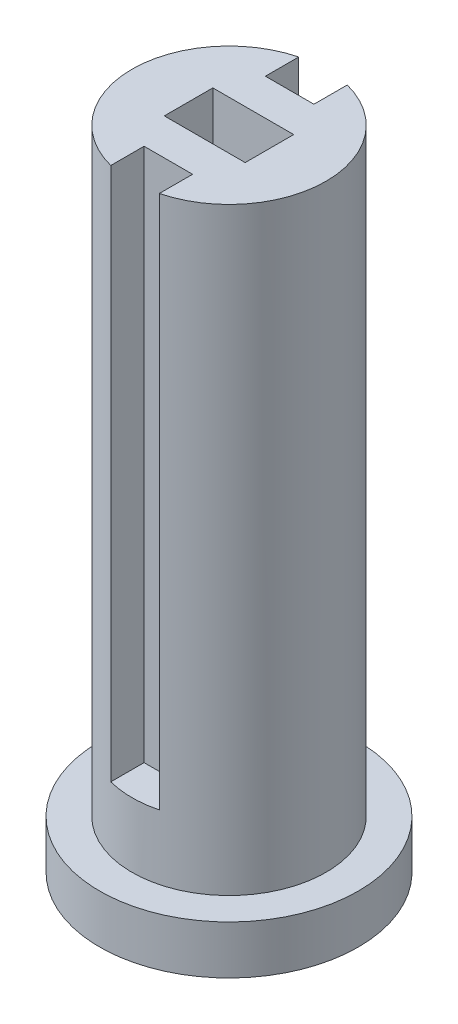
ISO-10303-21;
HEADER;
FILE_DESCRIPTION(('STEP AP214'),'2;1');
FILE_NAME('part.step','',(''),(''),'','','');
FILE_SCHEMA(('AUTOMOTIVE_DESIGN { 1 0 10303 214 1 1 1 1 }'));
ENDSEC;
DATA;
#1=APPLICATION_CONTEXT('core data for automotive mechanical design processes');
#2=APPLICATION_PROTOCOL_DEFINITION('international standard','automotive_design',2000,#1);
#3=PRODUCT_CONTEXT('',#1,'mechanical');
#4=PRODUCT('Part','Part','',(#3));
#5=PRODUCT_RELATED_PRODUCT_CATEGORY('part','',(#4));
#6=PRODUCT_DEFINITION_FORMATION('','',#4);
#7=PRODUCT_DEFINITION_CONTEXT('part definition',#1,'design');
#8=PRODUCT_DEFINITION('design','',#6,#7);
#9=PRODUCT_DEFINITION_SHAPE('','',#8);
#10=(LENGTH_UNIT() NAMED_UNIT(*) SI_UNIT(.MILLI.,.METRE.));
#11=(NAMED_UNIT(*) PLANE_ANGLE_UNIT() SI_UNIT($,.RADIAN.));
#12=(NAMED_UNIT(*) SI_UNIT($,.STERADIAN.) SOLID_ANGLE_UNIT());
#13=UNCERTAINTY_MEASURE_WITH_UNIT(LENGTH_MEASURE(1.E-05),#10,'distance_accuracy_value','');
#14=(GEOMETRIC_REPRESENTATION_CONTEXT(3) GLOBAL_UNCERTAINTY_ASSIGNED_CONTEXT((#13)) GLOBAL_UNIT_ASSIGNED_CONTEXT((#10,
#11,#12)) REPRESENTATION_CONTEXT('',''));
#15=CARTESIAN_POINT('',(0.,0.,0.));
#16=DIRECTION('',(0.,0.,1.));
#17=DIRECTION('',(1.,0.,0.));
#18=AXIS2_PLACEMENT_3D('',#15,#16,#17);
#19=CARTESIAN_POINT('',(-4.03061224489797,30.,0.));
#20=DIRECTION('',(0.,-1.,0.));
#21=DIRECTION('',(1.,0.,0.));
#22=AXIS2_PLACEMENT_3D('',#19,#20,#21);
#23=PLANE('',#22);
#24=DIRECTION('',(-1.,0.,0.));
#25=VECTOR('',#24,1.);
#26=CARTESIAN_POINT('',(-12.530612244898,30.,-1.5));
#27=LINE('',#26,#25);
#28=CARTESIAN_POINT('',(-7.53061224489797,30.,-1.5));
#29=VERTEX_POINT('',#28);
#30=CARTESIAN_POINT('',(-12.530612244898,30.,-1.5));
#31=VERTEX_POINT('',#30);
#32=EDGE_CURVE('E180',#29,#31,#27,.T.);
#33=ORIENTED_EDGE('',*,*,#32,.F.);
#34=DIRECTION('',(0.,0.,-1.));
#35=VECTOR('',#34,1.);
#36=CARTESIAN_POINT('',(-7.53061224489797,30.,0.499999999999999));
#37=LINE('',#36,#35);
#38=CARTESIAN_POINT('',(-7.53061224489797,30.,1.5));
#39=VERTEX_POINT('',#38);
#40=EDGE_CURVE('E187',#39,#29,#37,.T.);
#41=ORIENTED_EDGE('',*,*,#40,.F.);
#42=DIRECTION('',(1.,0.,0.));
#43=VECTOR('',#42,1.);
#44=CARTESIAN_POINT('',(-7.53061224489797,30.,1.5));
#45=LINE('',#44,#43);
#46=CARTESIAN_POINT('',(-12.530612244898,30.,1.5));
#47=VERTEX_POINT('',#46);
#48=EDGE_CURVE('E201',#47,#39,#45,.T.);
#49=ORIENTED_EDGE('',*,*,#48,.F.);
#50=DIRECTION('',(0.,0.,1.));
#51=VECTOR('',#50,1.);
#52=CARTESIAN_POINT('',(-12.530612244898,30.,1.5));
#53=LINE('',#52,#51);
#54=EDGE_CURVE('E198',#31,#47,#53,.T.);
#55=ORIENTED_EDGE('',*,*,#54,.F.);
#56=EDGE_LOOP('',(#33,#41,#49,#55));
#57=FACE_BOUND('',#56,.T.);
#58=DIRECTION('',(1.,0.,0.));
#59=VECTOR('',#58,1.);
#60=CARTESIAN_POINT('',(-10.030612244898,30.,-3.75));
#61=LINE('',#60,#59);
#62=CARTESIAN_POINT('',(-11.530612244898,30.,-3.75));
#63=VERTEX_POINT('',#62);
#64=CARTESIAN_POINT('',(-8.53061224489797,30.,-3.75));
#65=VERTEX_POINT('',#64);
#66=EDGE_CURVE('E143',#63,#65,#61,.T.);
#67=ORIENTED_EDGE('',*,*,#66,.F.);
#68=DIRECTION('',(0.,0.,1.));
#69=VECTOR('',#68,1.);
#70=CARTESIAN_POINT('',(-11.530612244898,30.,-3.75));
#71=LINE('',#70,#69);
#72=CARTESIAN_POINT('',(-11.530612244898,30.,-5.80947501931112));
#73=VERTEX_POINT('',#72);
#74=EDGE_CURVE('E156',#73,#63,#71,.T.);
#75=ORIENTED_EDGE('',*,*,#74,.F.);
#76=CARTESIAN_POINT('',(-10.030612244898,30.,0.));
#77=DIRECTION('',(0.,1.,0.));
#78=DIRECTION('',(-1.,0.,0.));
#79=AXIS2_PLACEMENT_3D('',#76,#77,#78);
#80=CIRCLE('',#79,6.);
#81=CARTESIAN_POINT('',(-11.530612244898,30.,5.80947501931112));
#82=VERTEX_POINT('',#81);
#83=EDGE_CURVE('E208',#73,#82,#80,.T.);
#84=ORIENTED_EDGE('',*,*,#83,.T.);
#85=DIRECTION('',(0.,0.,1.));
#86=VECTOR('',#85,1.);
#87=CARTESIAN_POINT('',(-11.530612244898,30.,3.75));
#88=LINE('',#87,#86);
#89=CARTESIAN_POINT('',(-11.530612244898,30.,3.75));
#90=VERTEX_POINT('',#89);
#91=EDGE_CURVE('E168',#90,#82,#88,.T.);
#92=ORIENTED_EDGE('',*,*,#91,.F.);
#93=DIRECTION('',(-1.,0.,0.));
#94=VECTOR('',#93,1.);
#95=CARTESIAN_POINT('',(-10.030612244898,30.,3.75));
#96=LINE('',#95,#94);
#97=CARTESIAN_POINT('',(-8.53061224489797,30.,3.75));
#98=VERTEX_POINT('',#97);
#99=EDGE_CURVE('E173',#98,#90,#96,.T.);
#100=ORIENTED_EDGE('',*,*,#99,.F.);
#101=DIRECTION('',(0.,0.,-1.));
#102=VECTOR('',#101,1.);
#103=CARTESIAN_POINT('',(-8.53061224489797,30.,6.14726512922367));
#104=LINE('',#103,#102);
#105=CARTESIAN_POINT('',(-8.53061224489797,30.,5.80947501931112));
#106=VERTEX_POINT('',#105);
#107=EDGE_CURVE('E163',#106,#98,#104,.T.);
#108=ORIENTED_EDGE('',*,*,#107,.F.);
#109=CARTESIAN_POINT('',(-8.53061224489797,30.,-5.80947501931112));
#110=VERTEX_POINT('',#109);
#111=EDGE_CURVE('E214',#106,#110,#80,.T.);
#112=ORIENTED_EDGE('',*,*,#111,.T.);
#113=DIRECTION('',(0.,0.,-1.));
#114=VECTOR('',#113,1.);
#115=CARTESIAN_POINT('',(-8.53061224489797,30.,-6.14726512922367));
#116=LINE('',#115,#114);
#117=EDGE_CURVE('E160',#65,#110,#116,.T.);
#118=ORIENTED_EDGE('',*,*,#117,.F.);
#119=EDGE_LOOP('',(#67,#75,#84,#92,#100,#108,#112,#118));
#120=FACE_BOUND('',#119,.T.);
#121=ADVANCED_FACE('F48',(#57,#120),#23,.F.);
#122=CARTESIAN_POINT('',(-10.030612244898,-10.,0.));
#123=DIRECTION('',(0.,1.,0.));
#124=DIRECTION('',(-1.,0.,0.));
#125=AXIS2_PLACEMENT_3D('',#122,#123,#124);
#126=PLANE('',#125);
#127=CARTESIAN_POINT('',(-10.030612244898,-10.,0.));
#128=DIRECTION('',(0.,1.,0.));
#129=DIRECTION('',(-1.,0.,0.));
#130=AXIS2_PLACEMENT_3D('',#127,#128,#129);
#131=CIRCLE('',#130,8.);
#132=CARTESIAN_POINT('',(-18.030612244898,-10.,0.));
#133=VERTEX_POINT('',#132);
#134=EDGE_CURVE('E223',#133,#133,#131,.T.);
#135=ORIENTED_EDGE('',*,*,#134,.F.);
#136=EDGE_LOOP('',(#135));
#137=FACE_BOUND('',#136,.T.);
#138=ADVANCED_FACE('F269',(#137),#126,.F.);
#139=CARTESIAN_POINT('',(-10.030612244898,30.,0.));
#140=DIRECTION('',(0.,1.,0.));
#141=DIRECTION('',(-1.,0.,0.));
#142=AXIS2_PLACEMENT_3D('',#139,#140,#141);
#143=CYLINDRICAL_SURFACE('',#142,8.);
#144=CARTESIAN_POINT('',(-10.030612244898,-7.,0.));
#145=DIRECTION('',(0.,1.,0.));
#146=DIRECTION('',(-1.,0.,0.));
#147=AXIS2_PLACEMENT_3D('',#144,#145,#146);
#148=CIRCLE('',#147,8.);
#149=CARTESIAN_POINT('',(-18.030612244898,-7.,0.));
#150=VERTEX_POINT('',#149);
#151=EDGE_CURVE('E220',#150,#150,#148,.T.);
#152=ORIENTED_EDGE('',*,*,#151,.F.);
#153=EDGE_LOOP('',(#152));
#154=FACE_BOUND('',#153,.T.);
#155=ORIENTED_EDGE('',*,*,#134,.T.);
#156=EDGE_LOOP('',(#155));
#157=FACE_BOUND('',#156,.T.);
#158=ADVANCED_FACE('F274',(#154,#157),#143,.T.);
#159=CARTESIAN_POINT('',(-2.03061224489796,-7.,0.));
#160=DIRECTION('',(0.,-1.,0.));
#161=DIRECTION('',(1.,0.,0.));
#162=AXIS2_PLACEMENT_3D('',#159,#160,#161);
#163=PLANE('',#162);
#164=CARTESIAN_POINT('',(-10.030612244898,-7.00000000000001,0.));
#165=DIRECTION('',(0.,1.,0.));
#166=DIRECTION('',(-1.,0.,0.));
#167=AXIS2_PLACEMENT_3D('',#164,#165,#166);
#168=CIRCLE('',#167,6.);
#169=CARTESIAN_POINT('',(-16.030612244898,-7.00000000000001,0.));
#170=VERTEX_POINT('',#169);
#171=EDGE_CURVE('E217',#170,#170,#168,.T.);
#172=ORIENTED_EDGE('',*,*,#171,.F.);
#173=EDGE_LOOP('',(#172));
#174=FACE_BOUND('',#173,.T.);
#175=ORIENTED_EDGE('',*,*,#151,.T.);
#176=EDGE_LOOP('',(#175));
#177=FACE_BOUND('',#176,.T.);
#178=ADVANCED_FACE('F312',(#174,#177),#163,.F.);
#179=CARTESIAN_POINT('',(-10.030612244898,30.,0.));
#180=DIRECTION('',(0.,1.,0.));
#181=DIRECTION('',(-1.,0.,0.));
#182=AXIS2_PLACEMENT_3D('',#179,#180,#181);
#183=CYLINDRICAL_SURFACE('',#182,6.);
#184=ORIENTED_EDGE('',*,*,#83,.F.);
#185=DIRECTION('',(0.,1.,0.));
#186=VECTOR('',#185,1.);
#187=CARTESIAN_POINT('',(-11.530612244898,30.,-5.80947501931112));
#188=LINE('',#187,#186);
#189=CARTESIAN_POINT('',(-11.530612244898,-3.00000000000001,-5.80947501931112));
#190=VERTEX_POINT('',#189);
#191=EDGE_CURVE('E13',#73,#190,#188,.F.);
#192=ORIENTED_EDGE('',*,*,#191,.T.);
#193=CARTESIAN_POINT('',(-10.030612244898,-3.00000000000001,0.));
#194=DIRECTION('',(0.,-1.,0.));
#195=DIRECTION('',(0.,0.,-1.));
#196=AXIS2_PLACEMENT_3D('',#193,#194,#195);
#197=CIRCLE('',#196,6.);
#198=CARTESIAN_POINT('',(-8.53061224489797,-3.00000000000001,-5.80947501931112));
#199=VERTEX_POINT('',#198);
#200=EDGE_CURVE('E234',#190,#199,#197,.T.);
#201=ORIENTED_EDGE('',*,*,#200,.T.);
#202=DIRECTION('',(0.,1.,0.));
#203=VECTOR('',#202,1.);
#204=CARTESIAN_POINT('',(-8.53061224489797,30.,-5.80947501931112));
#205=LINE('',#204,#203);
#206=EDGE_CURVE('E55',#199,#110,#205,.T.);
#207=ORIENTED_EDGE('',*,*,#206,.T.);
#208=ORIENTED_EDGE('',*,*,#111,.F.);
#209=DIRECTION('',(0.,1.,0.));
#210=VECTOR('',#209,1.);
#211=CARTESIAN_POINT('',(-8.53061224489797,30.,5.80947501931112));
#212=LINE('',#211,#210);
#213=CARTESIAN_POINT('',(-8.53061224489797,-3.00000000000001,5.80947501931112));
#214=VERTEX_POINT('',#213);
#215=EDGE_CURVE('E231',#106,#214,#212,.F.);
#216=ORIENTED_EDGE('',*,*,#215,.T.);
#217=CARTESIAN_POINT('',(-10.030612244898,-3.00000000000001,0.));
#218=DIRECTION('',(0.,1.,0.));
#219=DIRECTION('',(0.,0.,1.));
#220=AXIS2_PLACEMENT_3D('',#217,#218,#219);
#221=CIRCLE('',#220,6.);
#222=CARTESIAN_POINT('',(-11.530612244898,-3.00000000000001,5.80947501931112));
#223=VERTEX_POINT('',#222);
#224=EDGE_CURVE('E226',#223,#214,#221,.T.);
#225=ORIENTED_EDGE('',*,*,#224,.F.);
#226=DIRECTION('',(0.,1.,0.));
#227=VECTOR('',#226,1.);
#228=CARTESIAN_POINT('',(-11.530612244898,30.,5.80947501931112));
#229=LINE('',#228,#227);
#230=EDGE_CURVE('E228',#223,#82,#229,.T.);
#231=ORIENTED_EDGE('',*,*,#230,.T.);
#232=EDGE_LOOP('',(#184,#192,#201,#207,#208,#216,#225,#231));
#233=FACE_BOUND('',#232,.T.);
#234=ORIENTED_EDGE('',*,*,#171,.T.);
#235=EDGE_LOOP('',(#234));
#236=FACE_BOUND('',#235,.T.);
#237=ADVANCED_FACE('F238',(#233,#236),#183,.T.);
#238=CARTESIAN_POINT('',(-7.53061224489797,22.,0.499999999999999));
#239=DIRECTION('',(1.,0.,0.));
#240=DIRECTION('',(0.,0.,-1.));
#241=AXIS2_PLACEMENT_3D('',#238,#239,#240);
#242=PLANE('',#241);
#243=ORIENTED_EDGE('',*,*,#40,.T.);
#244=DIRECTION('',(0.,1.,0.));
#245=VECTOR('',#244,1.);
#246=CARTESIAN_POINT('',(-7.53061224489797,22.,-1.5));
#247=LINE('',#246,#245);
#248=CARTESIAN_POINT('',(-7.53061224489797,22.,-1.5));
#249=VERTEX_POINT('',#248);
#250=EDGE_CURVE('E195',#249,#29,#247,.T.);
#251=ORIENTED_EDGE('',*,*,#250,.F.);
#252=DIRECTION('',(0.,0.,-1.));
#253=VECTOR('',#252,1.);
#254=CARTESIAN_POINT('',(-7.53061224489797,22.,-0.500000000000002));
#255=LINE('',#254,#253);
#256=CARTESIAN_POINT('',(-7.53061224489797,22.,1.5));
#257=VERTEX_POINT('',#256);
#258=EDGE_CURVE('E183',#257,#249,#255,.T.);
#259=ORIENTED_EDGE('',*,*,#258,.F.);
#260=DIRECTION('',(0.,1.,0.));
#261=VECTOR('',#260,1.);
#262=CARTESIAN_POINT('',(-7.53061224489797,22.,1.5));
#263=LINE('',#262,#261);
#264=EDGE_CURVE('E206',#257,#39,#263,.T.);
#265=ORIENTED_EDGE('',*,*,#264,.T.);
#266=EDGE_LOOP('',(#243,#251,#259,#265));
#267=FACE_BOUND('',#266,.T.);
#268=ADVANCED_FACE('F285',(#267),#242,.F.);
#269=CARTESIAN_POINT('',(-7.53061224489797,22.,1.5));
#270=DIRECTION('',(0.,0.,1.));
#271=DIRECTION('',(1.,0.,0.));
#272=AXIS2_PLACEMENT_3D('',#269,#270,#271);
#273=PLANE('',#272);
#274=ORIENTED_EDGE('',*,*,#48,.T.);
#275=ORIENTED_EDGE('',*,*,#264,.F.);
#276=DIRECTION('',(1.,0.,0.));
#277=VECTOR('',#276,1.);
#278=CARTESIAN_POINT('',(-7.53061224489797,22.,1.5));
#279=LINE('',#278,#277);
#280=CARTESIAN_POINT('',(-12.530612244898,22.,1.5));
#281=VERTEX_POINT('',#280);
#282=EDGE_CURVE('E192',#281,#257,#279,.T.);
#283=ORIENTED_EDGE('',*,*,#282,.F.);
#284=DIRECTION('',(0.,1.,0.));
#285=VECTOR('',#284,1.);
#286=CARTESIAN_POINT('',(-12.530612244898,22.,1.5));
#287=LINE('',#286,#285);
#288=EDGE_CURVE('E209',#281,#47,#287,.T.);
#289=ORIENTED_EDGE('',*,*,#288,.T.);
#290=EDGE_LOOP('',(#274,#275,#283,#289));
#291=FACE_BOUND('',#290,.T.);
#292=ADVANCED_FACE('F289',(#291),#273,.F.);
#293=CARTESIAN_POINT('',(-12.530612244898,22.,1.5));
#294=DIRECTION('',(-1.,0.,0.));
#295=DIRECTION('',(0.,-1.,0.));
#296=AXIS2_PLACEMENT_3D('',#293,#294,#295);
#297=PLANE('',#296);
#298=ORIENTED_EDGE('',*,*,#54,.T.);
#299=ORIENTED_EDGE('',*,*,#288,.F.);
#300=DIRECTION('',(0.,0.,1.));
#301=VECTOR('',#300,1.);
#302=CARTESIAN_POINT('',(-12.530612244898,22.,-0.5));
#303=LINE('',#302,#301);
#304=CARTESIAN_POINT('',(-12.530612244898,22.,-1.5));
#305=VERTEX_POINT('',#304);
#306=EDGE_CURVE('E190',#305,#281,#303,.T.);
#307=ORIENTED_EDGE('',*,*,#306,.F.);
#308=DIRECTION('',(0.,1.,0.));
#309=VECTOR('',#308,1.);
#310=CARTESIAN_POINT('',(-12.530612244898,22.,-1.5));
#311=LINE('',#310,#309);
#312=EDGE_CURVE('E211',#305,#31,#311,.T.);
#313=ORIENTED_EDGE('',*,*,#312,.T.);
#314=EDGE_LOOP('',(#298,#299,#307,#313));
#315=FACE_BOUND('',#314,.T.);
#316=ADVANCED_FACE('F292',(#315),#297,.F.);
#317=CARTESIAN_POINT('',(-12.530612244898,22.,-1.5));
#318=DIRECTION('',(0.,0.,-1.));
#319=DIRECTION('',(-1.,0.,0.));
#320=AXIS2_PLACEMENT_3D('',#317,#318,#319);
#321=PLANE('',#320);
#322=ORIENTED_EDGE('',*,*,#32,.T.);
#323=ORIENTED_EDGE('',*,*,#312,.F.);
#324=DIRECTION('',(-1.,0.,0.));
#325=VECTOR('',#324,1.);
#326=CARTESIAN_POINT('',(-12.530612244898,22.,-1.5));
#327=LINE('',#326,#325);
#328=EDGE_CURVE('E186',#249,#305,#327,.T.);
#329=ORIENTED_EDGE('',*,*,#328,.F.);
#330=ORIENTED_EDGE('',*,*,#250,.T.);
#331=EDGE_LOOP('',(#322,#323,#329,#330));
#332=FACE_BOUND('',#331,.T.);
#333=ADVANCED_FACE('F281',(#332),#321,.F.);
#334=CARTESIAN_POINT('',(0.,22.,0.));
#335=DIRECTION('',(0.,-1.,0.));
#336=DIRECTION('',(0.,0.,-1.));
#337=AXIS2_PLACEMENT_3D('',#334,#335,#336);
#338=PLANE('',#337);
#339=ORIENTED_EDGE('',*,*,#258,.T.);
#340=ORIENTED_EDGE('',*,*,#328,.T.);
#341=ORIENTED_EDGE('',*,*,#306,.T.);
#342=ORIENTED_EDGE('',*,*,#282,.T.);
#343=EDGE_LOOP('',(#339,#340,#341,#342));
#344=FACE_BOUND('',#343,.T.);
#345=ADVANCED_FACE('F294',(#344),#338,.F.);
#346=CARTESIAN_POINT('',(-8.53061224489797,-3.00000000000001,6.14726512922367));
#347=DIRECTION('',(1.,0.,0.));
#348=DIRECTION('',(0.,1.,0.));
#349=AXIS2_PLACEMENT_3D('',#346,#347,#348);
#350=PLANE('',#349);
#351=ORIENTED_EDGE('',*,*,#107,.T.);
#352=DIRECTION('',(0.,1.,0.));
#353=VECTOR('',#352,1.);
#354=CARTESIAN_POINT('',(-8.53061224489797,-3.00000000000001,3.75));
#355=LINE('',#354,#353);
#356=CARTESIAN_POINT('',(-8.53061224489797,-3.00000000000001,3.75));
#357=VERTEX_POINT('',#356);
#358=EDGE_CURVE('E171',#357,#98,#355,.T.);
#359=ORIENTED_EDGE('',*,*,#358,.F.);
#360=DIRECTION('',(0.,0.,-1.));
#361=VECTOR('',#360,1.);
#362=CARTESIAN_POINT('',(-8.53061224489797,-3.00000000000001,6.14726512922367));
#363=LINE('',#362,#361);
#364=EDGE_CURVE('E165',#214,#357,#363,.T.);
#365=ORIENTED_EDGE('',*,*,#364,.F.);
#366=ORIENTED_EDGE('',*,*,#215,.F.);
#367=EDGE_LOOP('',(#351,#359,#365,#366));
#368=FACE_BOUND('',#367,.T.);
#369=ADVANCED_FACE('F246',(#368),#350,.F.);
#370=CARTESIAN_POINT('',(-11.530612244898,-3.00000000000001,3.75));
#371=DIRECTION('',(-1.,0.,0.));
#372=DIRECTION('',(0.,-1.,0.));
#373=AXIS2_PLACEMENT_3D('',#370,#371,#372);
#374=PLANE('',#373);
#375=DIRECTION('',(0.,0.,1.));
#376=VECTOR('',#375,1.);
#377=CARTESIAN_POINT('',(-11.530612244898,-3.00000000000001,3.75));
#378=LINE('',#377,#376);
#379=CARTESIAN_POINT('',(-11.530612244898,-3.00000000000001,3.75));
#380=VERTEX_POINT('',#379);
#381=EDGE_CURVE('E70',#380,#223,#378,.T.);
#382=ORIENTED_EDGE('',*,*,#381,.F.);
#383=DIRECTION('',(0.,1.,0.));
#384=VECTOR('',#383,1.);
#385=CARTESIAN_POINT('',(-11.530612244898,-3.00000000000001,3.75));
#386=LINE('',#385,#384);
#387=EDGE_CURVE('E178',#380,#90,#386,.T.);
#388=ORIENTED_EDGE('',*,*,#387,.T.);
#389=ORIENTED_EDGE('',*,*,#91,.T.);
#390=ORIENTED_EDGE('',*,*,#230,.F.);
#391=EDGE_LOOP('',(#382,#388,#389,#390));
#392=FACE_BOUND('',#391,.T.);
#393=ADVANCED_FACE('F255',(#392),#374,.F.);
#394=CARTESIAN_POINT('',(0.,-3.00000000000001,0.));
#395=DIRECTION('',(0.,1.,0.));
#396=DIRECTION('',(0.,0.,1.));
#397=AXIS2_PLACEMENT_3D('',#394,#395,#396);
#398=PLANE('',#397);
#399=ORIENTED_EDGE('',*,*,#224,.T.);
#400=ORIENTED_EDGE('',*,*,#364,.T.);
#401=DIRECTION('',(-1.,0.,0.));
#402=VECTOR('',#401,1.);
#403=CARTESIAN_POINT('',(-8.53061224489797,-3.00000000000001,3.75));
#404=LINE('',#403,#402);
#405=EDGE_CURVE('E167',#357,#380,#404,.T.);
#406=ORIENTED_EDGE('',*,*,#405,.T.);
#407=ORIENTED_EDGE('',*,*,#381,.T.);
#408=EDGE_LOOP('',(#399,#400,#406,#407));
#409=FACE_BOUND('',#408,.T.);
#410=ADVANCED_FACE('F252',(#409),#398,.T.);
#411=CARTESIAN_POINT('',(-10.030612244898,-3.00000000000001,3.75));
#412=DIRECTION('',(0.,0.,-1.));
#413=DIRECTION('',(-1.,0.,0.));
#414=AXIS2_PLACEMENT_3D('',#411,#412,#413);
#415=PLANE('',#414);
#416=ORIENTED_EDGE('',*,*,#99,.T.);
#417=ORIENTED_EDGE('',*,*,#387,.F.);
#418=ORIENTED_EDGE('',*,*,#405,.F.);
#419=ORIENTED_EDGE('',*,*,#358,.T.);
#420=EDGE_LOOP('',(#416,#417,#418,#419));
#421=FACE_BOUND('',#420,.T.);
#422=ADVANCED_FACE('F250',(#421),#415,.F.);
#423=CARTESIAN_POINT('',(-11.530612244898,-3.00000000000001,-3.75));
#424=DIRECTION('',(-1.,0.,0.));
#425=DIRECTION('',(0.,-1.,0.));
#426=AXIS2_PLACEMENT_3D('',#423,#424,#425);
#427=PLANE('',#426);
#428=ORIENTED_EDGE('',*,*,#74,.T.);
#429=DIRECTION('',(0.,1.,0.));
#430=VECTOR('',#429,1.);
#431=CARTESIAN_POINT('',(-11.530612244898,-3.00000000000001,-3.75));
#432=LINE('',#431,#430);
#433=CARTESIAN_POINT('',(-11.530612244898,-3.00000000000001,-3.75));
#434=VERTEX_POINT('',#433);
#435=EDGE_CURVE('E146',#434,#63,#432,.T.);
#436=ORIENTED_EDGE('',*,*,#435,.F.);
#437=DIRECTION('',(0.,0.,1.));
#438=VECTOR('',#437,1.);
#439=CARTESIAN_POINT('',(-11.530612244898,-3.00000000000001,-3.75));
#440=LINE('',#439,#438);
#441=EDGE_CURVE('E147',#190,#434,#440,.T.);
#442=ORIENTED_EDGE('',*,*,#441,.F.);
#443=ORIENTED_EDGE('',*,*,#191,.F.);
#444=EDGE_LOOP('',(#428,#436,#442,#443));
#445=FACE_BOUND('',#444,.T.);
#446=ADVANCED_FACE('F258',(#445),#427,.F.);
#447=CARTESIAN_POINT('',(-8.53061224489797,-3.00000000000001,-6.14726512922367));
#448=DIRECTION('',(1.,0.,0.));
#449=DIRECTION('',(0.,1.,0.));
#450=AXIS2_PLACEMENT_3D('',#447,#448,#449);
#451=PLANE('',#450);
#452=DIRECTION('',(0.,0.,-1.));
#453=VECTOR('',#452,1.);
#454=CARTESIAN_POINT('',(-8.53061224489797,-3.00000000000001,-6.14726512922367));
#455=LINE('',#454,#453);
#456=CARTESIAN_POINT('',(-8.53061224489797,-3.00000000000001,-3.75));
#457=VERTEX_POINT('',#456);
#458=EDGE_CURVE('E62',#457,#199,#455,.T.);
#459=ORIENTED_EDGE('',*,*,#458,.F.);
#460=DIRECTION('',(0.,1.,0.));
#461=VECTOR('',#460,1.);
#462=CARTESIAN_POINT('',(-8.53061224489797,-3.00000000000001,-3.75));
#463=LINE('',#462,#461);
#464=EDGE_CURVE('E137',#457,#65,#463,.T.);
#465=ORIENTED_EDGE('',*,*,#464,.T.);
#466=ORIENTED_EDGE('',*,*,#117,.T.);
#467=ORIENTED_EDGE('',*,*,#206,.F.);
#468=EDGE_LOOP('',(#459,#465,#466,#467));
#469=FACE_BOUND('',#468,.T.);
#470=ADVANCED_FACE('F149',(#469),#451,.F.);
#471=CARTESIAN_POINT('',(0.,-3.00000000000001,0.));
#472=DIRECTION('',(0.,-1.,0.));
#473=DIRECTION('',(0.,0.,-1.));
#474=AXIS2_PLACEMENT_3D('',#471,#472,#473);
#475=PLANE('',#474);
#476=ORIENTED_EDGE('',*,*,#441,.T.);
#477=DIRECTION('',(1.,0.,0.));
#478=VECTOR('',#477,1.);
#479=CARTESIAN_POINT('',(-8.53061224489797,-3.00000000000001,-3.75));
#480=LINE('',#479,#478);
#481=EDGE_CURVE('E140',#434,#457,#480,.T.);
#482=ORIENTED_EDGE('',*,*,#481,.T.);
#483=ORIENTED_EDGE('',*,*,#458,.T.);
#484=ORIENTED_EDGE('',*,*,#200,.F.);
#485=EDGE_LOOP('',(#476,#482,#483,#484));
#486=FACE_BOUND('',#485,.T.);
#487=ADVANCED_FACE('F153',(#486),#475,.F.);
#488=CARTESIAN_POINT('',(-10.030612244898,-3.00000000000001,-3.75));
#489=DIRECTION('',(0.,0.,1.));
#490=DIRECTION('',(1.,0.,0.));
#491=AXIS2_PLACEMENT_3D('',#488,#489,#490);
#492=PLANE('',#491);
#493=ORIENTED_EDGE('',*,*,#66,.T.);
#494=ORIENTED_EDGE('',*,*,#464,.F.);
#495=ORIENTED_EDGE('',*,*,#481,.F.);
#496=ORIENTED_EDGE('',*,*,#435,.T.);
#497=EDGE_LOOP('',(#493,#494,#495,#496));
#498=FACE_BOUND('',#497,.T.);
#499=ADVANCED_FACE('F138',(#498),#492,.F.);
#500=CLOSED_SHELL('',(#121,#138,#158,#178,#237,#268,#292,#316,#333,#345,#369,#393,#410,#422,
#446,#470,#487,#499));
#501=MANIFOLD_SOLID_BREP('B2',#500);
#502=ADVANCED_BREP_SHAPE_REPRESENTATION('',(#18,#501),#14);
#503=SHAPE_DEFINITION_REPRESENTATION(#9,#502);
ENDSEC;
END-ISO-10303-21;
